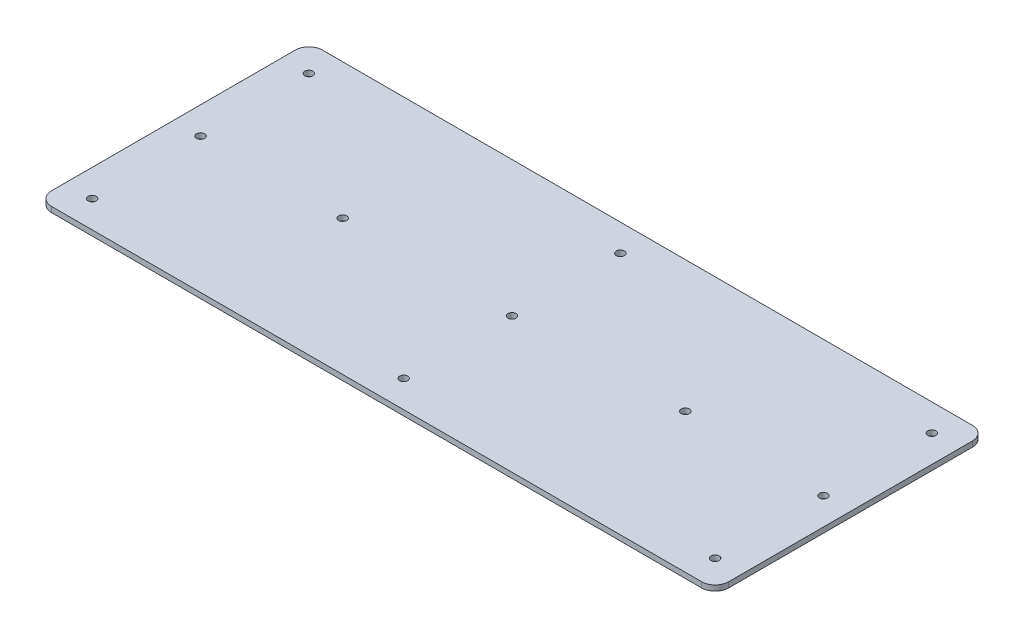
ISO-10303-21;
HEADER;
FILE_DESCRIPTION(('STEP AP214'),'2;1');
FILE_NAME('part.step','',(''),(''),'','','');
FILE_SCHEMA(('AUTOMOTIVE_DESIGN { 1 0 10303 214 1 1 1 1 }'));
ENDSEC;
DATA;
#1=APPLICATION_CONTEXT('core data for automotive mechanical design processes');
#2=APPLICATION_PROTOCOL_DEFINITION('international standard','automotive_design',2000,#1);
#3=PRODUCT_CONTEXT('',#1,'mechanical');
#4=PRODUCT('Part','Part','',(#3));
#5=PRODUCT_RELATED_PRODUCT_CATEGORY('part','',(#4));
#6=PRODUCT_DEFINITION_FORMATION('','',#4);
#7=PRODUCT_DEFINITION_CONTEXT('part definition',#1,'design');
#8=PRODUCT_DEFINITION('design','',#6,#7);
#9=PRODUCT_DEFINITION_SHAPE('','',#8);
#10=(LENGTH_UNIT() NAMED_UNIT(*) SI_UNIT(.MILLI.,.METRE.));
#11=(NAMED_UNIT(*) PLANE_ANGLE_UNIT() SI_UNIT($,.RADIAN.));
#12=(NAMED_UNIT(*) SI_UNIT($,.STERADIAN.) SOLID_ANGLE_UNIT());
#13=UNCERTAINTY_MEASURE_WITH_UNIT(LENGTH_MEASURE(1.E-05),#10,'distance_accuracy_value','');
#14=(GEOMETRIC_REPRESENTATION_CONTEXT(3) GLOBAL_UNCERTAINTY_ASSIGNED_CONTEXT((#13)) GLOBAL_UNIT_ASSIGNED_CONTEXT((#10,
#11,#12)) REPRESENTATION_CONTEXT('',''));
#15=CARTESIAN_POINT('',(0.,0.,0.));
#16=DIRECTION('',(0.,0.,1.));
#17=DIRECTION('',(1.,0.,0.));
#18=AXIS2_PLACEMENT_3D('',#15,#16,#17);
#19=CARTESIAN_POINT('',(120.,2.,-45.));
#20=DIRECTION('',(0.,1.,0.));
#21=DIRECTION('',(0.,0.,1.));
#22=AXIS2_PLACEMENT_3D('',#19,#20,#21);
#23=PLANE('',#22);
#24=CARTESIAN_POINT('',(-62.5,2.,0.));
#25=DIRECTION('',(0.,1.,0.));
#26=DIRECTION('',(0.,0.,1.));
#27=AXIS2_PLACEMENT_3D('',#24,#25,#26);
#28=CIRCLE('',#27,1.5);
#29=CARTESIAN_POINT('',(-62.5,2.,1.49999999999999));
#30=VERTEX_POINT('',#29);
#31=EDGE_CURVE('E231',#30,#30,#28,.T.);
#32=ORIENTED_EDGE('',*,*,#31,.F.);
#33=EDGE_LOOP('',(#32));
#34=FACE_BOUND('',#33,.T.);
#35=CARTESIAN_POINT('',(1.11022302462516E-13,2.,0.));
#36=DIRECTION('',(0.,1.,0.));
#37=DIRECTION('',(0.,0.,1.));
#38=AXIS2_PLACEMENT_3D('',#35,#36,#37);
#39=CIRCLE('',#38,1.5);
#40=CARTESIAN_POINT('',(1.11022302462516E-13,2.,1.49999999999996));
#41=VERTEX_POINT('',#40);
#42=EDGE_CURVE('E219',#41,#41,#39,.T.);
#43=ORIENTED_EDGE('',*,*,#42,.F.);
#44=EDGE_LOOP('',(#43));
#45=FACE_BOUND('',#44,.T.);
#46=CARTESIAN_POINT('',(0.,2.,40.));
#47=DIRECTION('',(0.,1.,0.));
#48=DIRECTION('',(0.,0.,1.));
#49=AXIS2_PLACEMENT_3D('',#46,#47,#48);
#50=CIRCLE('',#49,1.5);
#51=CARTESIAN_POINT('',(0.,2.,41.5));
#52=VERTEX_POINT('',#51);
#53=EDGE_CURVE('E207',#52,#52,#50,.T.);
#54=ORIENTED_EDGE('',*,*,#53,.F.);
#55=EDGE_LOOP('',(#54));
#56=FACE_BOUND('',#55,.T.);
#57=CARTESIAN_POINT('',(-115.,2.,0.));
#58=DIRECTION('',(0.,1.,0.));
#59=DIRECTION('',(0.,0.,1.));
#60=AXIS2_PLACEMENT_3D('',#57,#58,#59);
#61=CIRCLE('',#60,1.5);
#62=CARTESIAN_POINT('',(-115.,2.,1.50000000000002));
#63=VERTEX_POINT('',#62);
#64=EDGE_CURVE('E195',#63,#63,#61,.T.);
#65=ORIENTED_EDGE('',*,*,#64,.F.);
#66=EDGE_LOOP('',(#65));
#67=FACE_BOUND('',#66,.T.);
#68=CARTESIAN_POINT('',(-115.,2.,-40.));
#69=DIRECTION('',(0.,1.,0.));
#70=DIRECTION('',(0.,0.,1.));
#71=AXIS2_PLACEMENT_3D('',#68,#69,#70);
#72=CIRCLE('',#71,1.5);
#73=CARTESIAN_POINT('',(-115.,2.,-38.5));
#74=VERTEX_POINT('',#73);
#75=EDGE_CURVE('E183',#74,#74,#72,.T.);
#76=ORIENTED_EDGE('',*,*,#75,.F.);
#77=EDGE_LOOP('',(#76));
#78=FACE_BOUND('',#77,.T.);
#79=CARTESIAN_POINT('',(120.,2.,-45.));
#80=DIRECTION('',(0.,1.,0.));
#81=DIRECTION('',(0.,0.,1.));
#82=AXIS2_PLACEMENT_3D('',#79,#80,#81);
#83=CIRCLE('',#82,5.);
#84=CARTESIAN_POINT('',(125.,2.,-45.));
#85=VERTEX_POINT('',#84);
#86=CARTESIAN_POINT('',(120.,2.,-50.));
#87=VERTEX_POINT('',#86);
#88=EDGE_CURVE('E146',#85,#87,#83,.T.);
#89=ORIENTED_EDGE('',*,*,#88,.T.);
#90=DIRECTION('',(-1.,0.,0.));
#91=VECTOR('',#90,1.);
#92=CARTESIAN_POINT('',(-120.,2.,-50.));
#93=LINE('',#92,#91);
#94=CARTESIAN_POINT('',(-120.,2.,-50.));
#95=VERTEX_POINT('',#94);
#96=EDGE_CURVE('E94',#87,#95,#93,.T.);
#97=ORIENTED_EDGE('',*,*,#96,.T.);
#98=CARTESIAN_POINT('',(-120.,2.,-45.));
#99=DIRECTION('',(0.,1.,0.));
#100=DIRECTION('',(0.,0.,-1.));
#101=AXIS2_PLACEMENT_3D('',#98,#99,#100);
#102=CIRCLE('',#101,5.);
#103=CARTESIAN_POINT('',(-125.,2.,-45.));
#104=VERTEX_POINT('',#103);
#105=EDGE_CURVE('E161',#95,#104,#102,.T.);
#106=ORIENTED_EDGE('',*,*,#105,.T.);
#107=DIRECTION('',(0.,0.,1.));
#108=VECTOR('',#107,1.);
#109=CARTESIAN_POINT('',(-125.,2.,-45.));
#110=LINE('',#109,#108);
#111=CARTESIAN_POINT('',(-125.,2.,45.));
#112=VERTEX_POINT('',#111);
#113=EDGE_CURVE('E174',#104,#112,#110,.T.);
#114=ORIENTED_EDGE('',*,*,#113,.T.);
#115=CARTESIAN_POINT('',(-120.,2.,45.));
#116=DIRECTION('',(0.,1.,0.));
#117=DIRECTION('',(0.,0.,-1.));
#118=AXIS2_PLACEMENT_3D('',#115,#116,#117);
#119=CIRCLE('',#118,5.);
#120=CARTESIAN_POINT('',(-120.,2.,50.));
#121=VERTEX_POINT('',#120);
#122=EDGE_CURVE('E113',#112,#121,#119,.T.);
#123=ORIENTED_EDGE('',*,*,#122,.T.);
#124=DIRECTION('',(1.,0.,0.));
#125=VECTOR('',#124,1.);
#126=CARTESIAN_POINT('',(-120.,2.,50.));
#127=LINE('',#126,#125);
#128=CARTESIAN_POINT('',(120.,2.,50.));
#129=VERTEX_POINT('',#128);
#130=EDGE_CURVE('E107',#121,#129,#127,.T.);
#131=ORIENTED_EDGE('',*,*,#130,.T.);
#132=CARTESIAN_POINT('',(120.,2.,45.));
#133=DIRECTION('',(0.,1.,0.));
#134=DIRECTION('',(0.,0.,-1.));
#135=AXIS2_PLACEMENT_3D('',#132,#133,#134);
#136=CIRCLE('',#135,4.99999999999999);
#137=CARTESIAN_POINT('',(125.,2.,45.));
#138=VERTEX_POINT('',#137);
#139=EDGE_CURVE('E111',#129,#138,#136,.T.);
#140=ORIENTED_EDGE('',*,*,#139,.T.);
#141=DIRECTION('',(0.,0.,-1.));
#142=VECTOR('',#141,1.);
#143=CARTESIAN_POINT('',(125.,2.,-45.));
#144=LINE('',#143,#142);
#145=EDGE_CURVE('E51',#138,#85,#144,.T.);
#146=ORIENTED_EDGE('',*,*,#145,.T.);
#147=EDGE_LOOP('',(#89,#97,#106,#114,#123,#131,#140,#146));
#148=FACE_BOUND('',#147,.T.);
#149=CARTESIAN_POINT('',(0.,2.,-40.));
#150=DIRECTION('',(0.,1.,0.));
#151=DIRECTION('',(0.,0.,1.));
#152=AXIS2_PLACEMENT_3D('',#149,#150,#151);
#153=CIRCLE('',#152,1.5);
#154=CARTESIAN_POINT('',(0.,2.,-38.5));
#155=VERTEX_POINT('',#154);
#156=EDGE_CURVE('E135',#155,#155,#153,.T.);
#157=ORIENTED_EDGE('',*,*,#156,.F.);
#158=EDGE_LOOP('',(#157));
#159=FACE_BOUND('',#158,.T.);
#160=CARTESIAN_POINT('',(115.,2.,-40.));
#161=DIRECTION('',(0.,1.,0.));
#162=DIRECTION('',(0.,0.,1.));
#163=AXIS2_PLACEMENT_3D('',#160,#161,#162);
#164=CIRCLE('',#163,1.5);
#165=CARTESIAN_POINT('',(115.,2.,-38.5));
#166=VERTEX_POINT('',#165);
#167=EDGE_CURVE('E189',#166,#166,#164,.T.);
#168=ORIENTED_EDGE('',*,*,#167,.F.);
#169=EDGE_LOOP('',(#168));
#170=FACE_BOUND('',#169,.T.);
#171=CARTESIAN_POINT('',(-115.,2.,40.));
#172=DIRECTION('',(0.,1.,0.));
#173=DIRECTION('',(0.,0.,1.));
#174=AXIS2_PLACEMENT_3D('',#171,#172,#173);
#175=CIRCLE('',#174,1.5);
#176=CARTESIAN_POINT('',(-115.,2.,41.5));
#177=VERTEX_POINT('',#176);
#178=EDGE_CURVE('E201',#177,#177,#175,.T.);
#179=ORIENTED_EDGE('',*,*,#178,.F.);
#180=EDGE_LOOP('',(#179));
#181=FACE_BOUND('',#180,.T.);
#182=CARTESIAN_POINT('',(115.,2.,40.));
#183=DIRECTION('',(0.,1.,0.));
#184=DIRECTION('',(0.,0.,1.));
#185=AXIS2_PLACEMENT_3D('',#182,#183,#184);
#186=CIRCLE('',#185,1.5);
#187=CARTESIAN_POINT('',(115.,2.,41.5));
#188=VERTEX_POINT('',#187);
#189=EDGE_CURVE('E213',#188,#188,#186,.T.);
#190=ORIENTED_EDGE('',*,*,#189,.F.);
#191=EDGE_LOOP('',(#190));
#192=FACE_BOUND('',#191,.T.);
#193=CARTESIAN_POINT('',(115.,2.,0.));
#194=DIRECTION('',(0.,1.,0.));
#195=DIRECTION('',(0.,0.,1.));
#196=AXIS2_PLACEMENT_3D('',#193,#194,#195);
#197=CIRCLE('',#196,1.5);
#198=CARTESIAN_POINT('',(115.,2.,1.49999999999999));
#199=VERTEX_POINT('',#198);
#200=EDGE_CURVE('E225',#199,#199,#197,.T.);
#201=ORIENTED_EDGE('',*,*,#200,.F.);
#202=EDGE_LOOP('',(#201));
#203=FACE_BOUND('',#202,.T.);
#204=CARTESIAN_POINT('',(62.5,2.,-1.49999999999994));
#205=DIRECTION('',(0.,1.,0.));
#206=DIRECTION('',(0.,0.,1.));
#207=AXIS2_PLACEMENT_3D('',#204,#205,#206);
#208=CIRCLE('',#207,1.5);
#209=CARTESIAN_POINT('',(62.5,2.,0.));
#210=VERTEX_POINT('',#209);
#211=EDGE_CURVE('E237',#210,#210,#208,.T.);
#212=ORIENTED_EDGE('',*,*,#211,.F.);
#213=EDGE_LOOP('',(#212));
#214=FACE_BOUND('',#213,.T.);
#215=ADVANCED_FACE('F34',(#34,#45,#56,#67,#78,#148,#159,#170,#181,#192,#203,#214),#23,.T.);
#216=CARTESIAN_POINT('',(120.,0.,-45.));
#217=DIRECTION('',(0.,1.,0.));
#218=DIRECTION('',(0.,0.,1.));
#219=AXIS2_PLACEMENT_3D('',#216,#217,#218);
#220=PLANE('',#219);
#221=CARTESIAN_POINT('',(120.,0.,-45.));
#222=DIRECTION('',(0.,1.,0.));
#223=DIRECTION('',(0.,0.,1.));
#224=AXIS2_PLACEMENT_3D('',#221,#222,#223);
#225=CIRCLE('',#224,5.);
#226=CARTESIAN_POINT('',(125.,0.,-45.));
#227=VERTEX_POINT('',#226);
#228=CARTESIAN_POINT('',(120.,0.,-50.));
#229=VERTEX_POINT('',#228);
#230=EDGE_CURVE('E131',#227,#229,#225,.T.);
#231=ORIENTED_EDGE('',*,*,#230,.F.);
#232=DIRECTION('',(0.,0.,-1.));
#233=VECTOR('',#232,1.);
#234=CARTESIAN_POINT('',(125.,0.,-45.));
#235=LINE('',#234,#233);
#236=CARTESIAN_POINT('',(125.,0.,45.));
#237=VERTEX_POINT('',#236);
#238=EDGE_CURVE('E86',#237,#227,#235,.T.);
#239=ORIENTED_EDGE('',*,*,#238,.F.);
#240=CARTESIAN_POINT('',(120.,0.,45.));
#241=DIRECTION('',(0.,1.,0.));
#242=DIRECTION('',(0.,0.,-1.));
#243=AXIS2_PLACEMENT_3D('',#240,#241,#242);
#244=CIRCLE('',#243,4.99999999999999);
#245=CARTESIAN_POINT('',(120.,0.,50.));
#246=VERTEX_POINT('',#245);
#247=EDGE_CURVE('E80',#246,#237,#244,.T.);
#248=ORIENTED_EDGE('',*,*,#247,.F.);
#249=DIRECTION('',(1.,0.,0.));
#250=VECTOR('',#249,1.);
#251=CARTESIAN_POINT('',(-120.,0.,50.));
#252=LINE('',#251,#250);
#253=CARTESIAN_POINT('',(-120.,0.,50.));
#254=VERTEX_POINT('',#253);
#255=EDGE_CURVE('E121',#254,#246,#252,.T.);
#256=ORIENTED_EDGE('',*,*,#255,.F.);
#257=CARTESIAN_POINT('',(-120.,0.,45.));
#258=DIRECTION('',(0.,1.,0.));
#259=DIRECTION('',(0.,0.,-1.));
#260=AXIS2_PLACEMENT_3D('',#257,#258,#259);
#261=CIRCLE('',#260,5.);
#262=CARTESIAN_POINT('',(-125.,0.,45.));
#263=VERTEX_POINT('',#262);
#264=EDGE_CURVE('E141',#263,#254,#261,.T.);
#265=ORIENTED_EDGE('',*,*,#264,.F.);
#266=DIRECTION('',(0.,0.,1.));
#267=VECTOR('',#266,1.);
#268=CARTESIAN_POINT('',(-125.,0.,-45.));
#269=LINE('',#268,#267);
#270=CARTESIAN_POINT('',(-125.,0.,-45.));
#271=VERTEX_POINT('',#270);
#272=EDGE_CURVE('E139',#271,#263,#269,.T.);
#273=ORIENTED_EDGE('',*,*,#272,.F.);
#274=CARTESIAN_POINT('',(-120.,0.,-45.));
#275=DIRECTION('',(0.,1.,0.));
#276=DIRECTION('',(0.,0.,-1.));
#277=AXIS2_PLACEMENT_3D('',#274,#275,#276);
#278=CIRCLE('',#277,5.);
#279=CARTESIAN_POINT('',(-120.,0.,-50.));
#280=VERTEX_POINT('',#279);
#281=EDGE_CURVE('E137',#280,#271,#278,.T.);
#282=ORIENTED_EDGE('',*,*,#281,.F.);
#283=DIRECTION('',(-1.,0.,0.));
#284=VECTOR('',#283,1.);
#285=CARTESIAN_POINT('',(-120.,0.,-50.));
#286=LINE('',#285,#284);
#287=EDGE_CURVE('E134',#229,#280,#286,.T.);
#288=ORIENTED_EDGE('',*,*,#287,.F.);
#289=EDGE_LOOP('',(#231,#239,#248,#256,#265,#273,#282,#288));
#290=FACE_BOUND('',#289,.T.);
#291=CARTESIAN_POINT('',(0.,0.,-40.));
#292=DIRECTION('',(0.,1.,0.));
#293=DIRECTION('',(0.,0.,1.));
#294=AXIS2_PLACEMENT_3D('',#291,#292,#293);
#295=CIRCLE('',#294,1.5);
#296=CARTESIAN_POINT('',(0.,0.,-38.5));
#297=VERTEX_POINT('',#296);
#298=EDGE_CURVE('E180',#297,#297,#295,.T.);
#299=ORIENTED_EDGE('',*,*,#298,.T.);
#300=EDGE_LOOP('',(#299));
#301=FACE_BOUND('',#300,.T.);
#302=CARTESIAN_POINT('',(-115.,0.,-40.));
#303=DIRECTION('',(0.,1.,0.));
#304=DIRECTION('',(0.,0.,1.));
#305=AXIS2_PLACEMENT_3D('',#302,#303,#304);
#306=CIRCLE('',#305,1.5);
#307=CARTESIAN_POINT('',(-115.,0.,-38.5));
#308=VERTEX_POINT('',#307);
#309=EDGE_CURVE('E186',#308,#308,#306,.T.);
#310=ORIENTED_EDGE('',*,*,#309,.T.);
#311=EDGE_LOOP('',(#310));
#312=FACE_BOUND('',#311,.T.);
#313=CARTESIAN_POINT('',(115.,0.,-40.));
#314=DIRECTION('',(0.,1.,0.));
#315=DIRECTION('',(0.,0.,1.));
#316=AXIS2_PLACEMENT_3D('',#313,#314,#315);
#317=CIRCLE('',#316,1.5);
#318=CARTESIAN_POINT('',(115.,0.,-38.5));
#319=VERTEX_POINT('',#318);
#320=EDGE_CURVE('E192',#319,#319,#317,.T.);
#321=ORIENTED_EDGE('',*,*,#320,.T.);
#322=EDGE_LOOP('',(#321));
#323=FACE_BOUND('',#322,.T.);
#324=CARTESIAN_POINT('',(-115.,0.,0.));
#325=DIRECTION('',(0.,1.,0.));
#326=DIRECTION('',(0.,0.,1.));
#327=AXIS2_PLACEMENT_3D('',#324,#325,#326);
#328=CIRCLE('',#327,1.5);
#329=CARTESIAN_POINT('',(-115.,0.,1.50000000000002));
#330=VERTEX_POINT('',#329);
#331=EDGE_CURVE('E198',#330,#330,#328,.T.);
#332=ORIENTED_EDGE('',*,*,#331,.T.);
#333=EDGE_LOOP('',(#332));
#334=FACE_BOUND('',#333,.T.);
#335=CARTESIAN_POINT('',(-115.,0.,40.));
#336=DIRECTION('',(0.,1.,0.));
#337=DIRECTION('',(0.,0.,1.));
#338=AXIS2_PLACEMENT_3D('',#335,#336,#337);
#339=CIRCLE('',#338,1.5);
#340=CARTESIAN_POINT('',(-115.,0.,41.5));
#341=VERTEX_POINT('',#340);
#342=EDGE_CURVE('E204',#341,#341,#339,.T.);
#343=ORIENTED_EDGE('',*,*,#342,.T.);
#344=EDGE_LOOP('',(#343));
#345=FACE_BOUND('',#344,.T.);
#346=CARTESIAN_POINT('',(0.,0.,40.));
#347=DIRECTION('',(0.,1.,0.));
#348=DIRECTION('',(0.,0.,1.));
#349=AXIS2_PLACEMENT_3D('',#346,#347,#348);
#350=CIRCLE('',#349,1.5);
#351=CARTESIAN_POINT('',(0.,0.,41.5));
#352=VERTEX_POINT('',#351);
#353=EDGE_CURVE('E210',#352,#352,#350,.T.);
#354=ORIENTED_EDGE('',*,*,#353,.T.);
#355=EDGE_LOOP('',(#354));
#356=FACE_BOUND('',#355,.T.);
#357=CARTESIAN_POINT('',(115.,0.,40.));
#358=DIRECTION('',(0.,1.,0.));
#359=DIRECTION('',(0.,0.,1.));
#360=AXIS2_PLACEMENT_3D('',#357,#358,#359);
#361=CIRCLE('',#360,1.5);
#362=CARTESIAN_POINT('',(115.,0.,41.5));
#363=VERTEX_POINT('',#362);
#364=EDGE_CURVE('E216',#363,#363,#361,.T.);
#365=ORIENTED_EDGE('',*,*,#364,.T.);
#366=EDGE_LOOP('',(#365));
#367=FACE_BOUND('',#366,.T.);
#368=CARTESIAN_POINT('',(1.11022302462516E-13,0.,0.));
#369=DIRECTION('',(0.,1.,0.));
#370=DIRECTION('',(0.,0.,1.));
#371=AXIS2_PLACEMENT_3D('',#368,#369,#370);
#372=CIRCLE('',#371,1.5);
#373=CARTESIAN_POINT('',(1.11022302462516E-13,0.,1.49999999999996));
#374=VERTEX_POINT('',#373);
#375=EDGE_CURVE('E222',#374,#374,#372,.T.);
#376=ORIENTED_EDGE('',*,*,#375,.T.);
#377=EDGE_LOOP('',(#376));
#378=FACE_BOUND('',#377,.T.);
#379=CARTESIAN_POINT('',(115.,0.,0.));
#380=DIRECTION('',(0.,1.,0.));
#381=DIRECTION('',(0.,0.,1.));
#382=AXIS2_PLACEMENT_3D('',#379,#380,#381);
#383=CIRCLE('',#382,1.5);
#384=CARTESIAN_POINT('',(115.,0.,1.49999999999999));
#385=VERTEX_POINT('',#384);
#386=EDGE_CURVE('E228',#385,#385,#383,.T.);
#387=ORIENTED_EDGE('',*,*,#386,.T.);
#388=EDGE_LOOP('',(#387));
#389=FACE_BOUND('',#388,.T.);
#390=CARTESIAN_POINT('',(-62.5,0.,0.));
#391=DIRECTION('',(0.,1.,0.));
#392=DIRECTION('',(0.,0.,1.));
#393=AXIS2_PLACEMENT_3D('',#390,#391,#392);
#394=CIRCLE('',#393,1.5);
#395=CARTESIAN_POINT('',(-62.5,0.,1.49999999999999));
#396=VERTEX_POINT('',#395);
#397=EDGE_CURVE('E234',#396,#396,#394,.T.);
#398=ORIENTED_EDGE('',*,*,#397,.T.);
#399=EDGE_LOOP('',(#398));
#400=FACE_BOUND('',#399,.T.);
#401=CARTESIAN_POINT('',(62.5,0.,-1.49999999999994));
#402=DIRECTION('',(0.,1.,0.));
#403=DIRECTION('',(0.,0.,1.));
#404=AXIS2_PLACEMENT_3D('',#401,#402,#403);
#405=CIRCLE('',#404,1.5);
#406=CARTESIAN_POINT('',(62.5,0.,0.));
#407=VERTEX_POINT('',#406);
#408=EDGE_CURVE('E240',#407,#407,#405,.T.);
#409=ORIENTED_EDGE('',*,*,#408,.T.);
#410=EDGE_LOOP('',(#409));
#411=FACE_BOUND('',#410,.T.);
#412=ADVANCED_FACE('F165',(#290,#301,#312,#323,#334,#345,#356,#367,#378,#389,#400,#411),#220,.F.);
#413=CARTESIAN_POINT('',(120.,2.,-45.));
#414=DIRECTION('',(0.,-1.,0.));
#415=DIRECTION('',(0.,0.,-1.));
#416=AXIS2_PLACEMENT_3D('',#413,#414,#415);
#417=CYLINDRICAL_SURFACE('',#416,5.);
#418=ORIENTED_EDGE('',*,*,#230,.T.);
#419=DIRECTION('',(0.,-1.,0.));
#420=VECTOR('',#419,1.);
#421=CARTESIAN_POINT('',(120.,2.,-50.));
#422=LINE('',#421,#420);
#423=EDGE_CURVE('E11',#87,#229,#422,.T.);
#424=ORIENTED_EDGE('',*,*,#423,.F.);
#425=ORIENTED_EDGE('',*,*,#88,.F.);
#426=DIRECTION('',(0.,-1.,0.));
#427=VECTOR('',#426,1.);
#428=CARTESIAN_POINT('',(125.,2.,-45.));
#429=LINE('',#428,#427);
#430=EDGE_CURVE('E127',#85,#227,#429,.T.);
#431=ORIENTED_EDGE('',*,*,#430,.T.);
#432=EDGE_LOOP('',(#418,#424,#425,#431));
#433=FACE_BOUND('',#432,.T.);
#434=ADVANCED_FACE('F36',(#433),#417,.T.);
#435=CARTESIAN_POINT('',(-120.,2.,-50.));
#436=DIRECTION('',(0.,0.,1.));
#437=DIRECTION('',(1.,0.,0.));
#438=AXIS2_PLACEMENT_3D('',#435,#436,#437);
#439=PLANE('',#438);
#440=ORIENTED_EDGE('',*,*,#287,.T.);
#441=DIRECTION('',(0.,-1.,0.));
#442=VECTOR('',#441,1.);
#443=CARTESIAN_POINT('',(-120.,2.,-50.));
#444=LINE('',#443,#442);
#445=EDGE_CURVE('E43',#95,#280,#444,.T.);
#446=ORIENTED_EDGE('',*,*,#445,.F.);
#447=ORIENTED_EDGE('',*,*,#96,.F.);
#448=ORIENTED_EDGE('',*,*,#423,.T.);
#449=EDGE_LOOP('',(#440,#446,#447,#448));
#450=FACE_BOUND('',#449,.T.);
#451=ADVANCED_FACE('F274',(#450),#439,.F.);
#452=CARTESIAN_POINT('',(-120.,2.,-45.));
#453=DIRECTION('',(0.,-1.,0.));
#454=DIRECTION('',(0.,0.,-1.));
#455=AXIS2_PLACEMENT_3D('',#452,#453,#454);
#456=CYLINDRICAL_SURFACE('',#455,5.);
#457=ORIENTED_EDGE('',*,*,#281,.T.);
#458=DIRECTION('',(0.,-1.,0.));
#459=VECTOR('',#458,1.);
#460=CARTESIAN_POINT('',(-125.,2.,-45.));
#461=LINE('',#460,#459);
#462=EDGE_CURVE('E153',#104,#271,#461,.T.);
#463=ORIENTED_EDGE('',*,*,#462,.F.);
#464=ORIENTED_EDGE('',*,*,#105,.F.);
#465=ORIENTED_EDGE('',*,*,#445,.T.);
#466=EDGE_LOOP('',(#457,#463,#464,#465));
#467=FACE_BOUND('',#466,.T.);
#468=ADVANCED_FACE('F159',(#467),#456,.T.);
#469=CARTESIAN_POINT('',(-125.,2.,-45.));
#470=DIRECTION('',(1.,0.,0.));
#471=DIRECTION('',(0.,0.,-1.));
#472=AXIS2_PLACEMENT_3D('',#469,#470,#471);
#473=PLANE('',#472);
#474=ORIENTED_EDGE('',*,*,#272,.T.);
#475=DIRECTION('',(0.,-1.,0.));
#476=VECTOR('',#475,1.);
#477=CARTESIAN_POINT('',(-125.,2.,45.));
#478=LINE('',#477,#476);
#479=EDGE_CURVE('E150',#112,#263,#478,.T.);
#480=ORIENTED_EDGE('',*,*,#479,.F.);
#481=ORIENTED_EDGE('',*,*,#113,.F.);
#482=ORIENTED_EDGE('',*,*,#462,.T.);
#483=EDGE_LOOP('',(#474,#480,#481,#482));
#484=FACE_BOUND('',#483,.T.);
#485=ADVANCED_FACE('F170',(#484),#473,.F.);
#486=CARTESIAN_POINT('',(-120.,2.,45.));
#487=DIRECTION('',(0.,-1.,0.));
#488=DIRECTION('',(0.,0.,-1.));
#489=AXIS2_PLACEMENT_3D('',#486,#487,#488);
#490=CYLINDRICAL_SURFACE('',#489,5.);
#491=ORIENTED_EDGE('',*,*,#264,.T.);
#492=DIRECTION('',(0.,-1.,0.));
#493=VECTOR('',#492,1.);
#494=CARTESIAN_POINT('',(-120.,2.,50.));
#495=LINE('',#494,#493);
#496=EDGE_CURVE('E122',#121,#254,#495,.T.);
#497=ORIENTED_EDGE('',*,*,#496,.F.);
#498=ORIENTED_EDGE('',*,*,#122,.F.);
#499=ORIENTED_EDGE('',*,*,#479,.T.);
#500=EDGE_LOOP('',(#491,#497,#498,#499));
#501=FACE_BOUND('',#500,.T.);
#502=ADVANCED_FACE('F173',(#501),#490,.T.);
#503=CARTESIAN_POINT('',(-120.,2.,50.));
#504=DIRECTION('',(0.,0.,-1.));
#505=DIRECTION('',(-1.,0.,0.));
#506=AXIS2_PLACEMENT_3D('',#503,#504,#505);
#507=PLANE('',#506);
#508=ORIENTED_EDGE('',*,*,#255,.T.);
#509=DIRECTION('',(0.,-1.,0.));
#510=VECTOR('',#509,1.);
#511=CARTESIAN_POINT('',(120.,2.,50.));
#512=LINE('',#511,#510);
#513=EDGE_CURVE('E118',#129,#246,#512,.T.);
#514=ORIENTED_EDGE('',*,*,#513,.F.);
#515=ORIENTED_EDGE('',*,*,#130,.F.);
#516=ORIENTED_EDGE('',*,*,#496,.T.);
#517=EDGE_LOOP('',(#508,#514,#515,#516));
#518=FACE_BOUND('',#517,.T.);
#519=ADVANCED_FACE('F119',(#518),#507,.F.);
#520=CARTESIAN_POINT('',(120.,2.,45.));
#521=DIRECTION('',(0.,-1.,0.));
#522=DIRECTION('',(0.,0.,-1.));
#523=AXIS2_PLACEMENT_3D('',#520,#521,#522);
#524=CYLINDRICAL_SURFACE('',#523,4.99999999999999);
#525=ORIENTED_EDGE('',*,*,#247,.T.);
#526=DIRECTION('',(0.,-1.,0.));
#527=VECTOR('',#526,1.);
#528=CARTESIAN_POINT('',(125.,2.,45.));
#529=LINE('',#528,#527);
#530=EDGE_CURVE('E123',#138,#237,#529,.T.);
#531=ORIENTED_EDGE('',*,*,#530,.F.);
#532=ORIENTED_EDGE('',*,*,#139,.F.);
#533=ORIENTED_EDGE('',*,*,#513,.T.);
#534=EDGE_LOOP('',(#525,#531,#532,#533));
#535=FACE_BOUND('',#534,.T.);
#536=ADVANCED_FACE('F125',(#535),#524,.T.);
#537=CARTESIAN_POINT('',(125.,2.,-45.));
#538=DIRECTION('',(-1.,0.,0.));
#539=DIRECTION('',(0.,0.,1.));
#540=AXIS2_PLACEMENT_3D('',#537,#538,#539);
#541=PLANE('',#540);
#542=ORIENTED_EDGE('',*,*,#238,.T.);
#543=ORIENTED_EDGE('',*,*,#430,.F.);
#544=ORIENTED_EDGE('',*,*,#145,.F.);
#545=ORIENTED_EDGE('',*,*,#530,.T.);
#546=EDGE_LOOP('',(#542,#543,#544,#545));
#547=FACE_BOUND('',#546,.T.);
#548=ADVANCED_FACE('F262',(#547),#541,.F.);
#549=CARTESIAN_POINT('',(0.,2.,-40.));
#550=DIRECTION('',(0.,-1.,0.));
#551=DIRECTION('',(0.,0.,-1.));
#552=AXIS2_PLACEMENT_3D('',#549,#550,#551);
#553=CYLINDRICAL_SURFACE('',#552,1.5);
#554=ORIENTED_EDGE('',*,*,#156,.T.);
#555=EDGE_LOOP('',(#554));
#556=FACE_BOUND('',#555,.T.);
#557=ORIENTED_EDGE('',*,*,#298,.F.);
#558=EDGE_LOOP('',(#557));
#559=FACE_BOUND('',#558,.T.);
#560=ADVANCED_FACE('F259',(#556,#559),#553,.F.);
#561=CARTESIAN_POINT('',(-115.,2.,-40.));
#562=DIRECTION('',(0.,-1.,0.));
#563=DIRECTION('',(0.,0.,-1.));
#564=AXIS2_PLACEMENT_3D('',#561,#562,#563);
#565=CYLINDRICAL_SURFACE('',#564,1.5);
#566=ORIENTED_EDGE('',*,*,#75,.T.);
#567=EDGE_LOOP('',(#566));
#568=FACE_BOUND('',#567,.T.);
#569=ORIENTED_EDGE('',*,*,#309,.F.);
#570=EDGE_LOOP('',(#569));
#571=FACE_BOUND('',#570,.T.);
#572=ADVANCED_FACE('F338',(#568,#571),#565,.F.);
#573=CARTESIAN_POINT('',(115.,2.,-40.));
#574=DIRECTION('',(0.,-1.,0.));
#575=DIRECTION('',(0.,0.,-1.));
#576=AXIS2_PLACEMENT_3D('',#573,#574,#575);
#577=CYLINDRICAL_SURFACE('',#576,1.5);
#578=ORIENTED_EDGE('',*,*,#167,.T.);
#579=EDGE_LOOP('',(#578));
#580=FACE_BOUND('',#579,.T.);
#581=ORIENTED_EDGE('',*,*,#320,.F.);
#582=EDGE_LOOP('',(#581));
#583=FACE_BOUND('',#582,.T.);
#584=ADVANCED_FACE('F346',(#580,#583),#577,.F.);
#585=CARTESIAN_POINT('',(-115.,2.,0.));
#586=DIRECTION('',(0.,-1.,0.));
#587=DIRECTION('',(0.,0.,-1.));
#588=AXIS2_PLACEMENT_3D('',#585,#586,#587);
#589=CYLINDRICAL_SURFACE('',#588,1.5);
#590=ORIENTED_EDGE('',*,*,#64,.T.);
#591=EDGE_LOOP('',(#590));
#592=FACE_BOUND('',#591,.T.);
#593=ORIENTED_EDGE('',*,*,#331,.F.);
#594=EDGE_LOOP('',(#593));
#595=FACE_BOUND('',#594,.T.);
#596=ADVANCED_FACE('F354',(#592,#595),#589,.F.);
#597=CARTESIAN_POINT('',(-115.,2.,40.));
#598=DIRECTION('',(0.,-1.,0.));
#599=DIRECTION('',(0.,0.,-1.));
#600=AXIS2_PLACEMENT_3D('',#597,#598,#599);
#601=CYLINDRICAL_SURFACE('',#600,1.5);
#602=ORIENTED_EDGE('',*,*,#178,.T.);
#603=EDGE_LOOP('',(#602));
#604=FACE_BOUND('',#603,.T.);
#605=ORIENTED_EDGE('',*,*,#342,.F.);
#606=EDGE_LOOP('',(#605));
#607=FACE_BOUND('',#606,.T.);
#608=ADVANCED_FACE('F363',(#604,#607),#601,.F.);
#609=CARTESIAN_POINT('',(0.,2.,40.));
#610=DIRECTION('',(0.,-1.,0.));
#611=DIRECTION('',(0.,0.,-1.));
#612=AXIS2_PLACEMENT_3D('',#609,#610,#611);
#613=CYLINDRICAL_SURFACE('',#612,1.5);
#614=ORIENTED_EDGE('',*,*,#53,.T.);
#615=EDGE_LOOP('',(#614));
#616=FACE_BOUND('',#615,.T.);
#617=ORIENTED_EDGE('',*,*,#353,.F.);
#618=EDGE_LOOP('',(#617));
#619=FACE_BOUND('',#618,.T.);
#620=ADVANCED_FACE('F372',(#616,#619),#613,.F.);
#621=CARTESIAN_POINT('',(115.,2.,40.));
#622=DIRECTION('',(0.,-1.,0.));
#623=DIRECTION('',(0.,0.,-1.));
#624=AXIS2_PLACEMENT_3D('',#621,#622,#623);
#625=CYLINDRICAL_SURFACE('',#624,1.5);
#626=ORIENTED_EDGE('',*,*,#189,.T.);
#627=EDGE_LOOP('',(#626));
#628=FACE_BOUND('',#627,.T.);
#629=ORIENTED_EDGE('',*,*,#364,.F.);
#630=EDGE_LOOP('',(#629));
#631=FACE_BOUND('',#630,.T.);
#632=ADVANCED_FACE('F381',(#628,#631),#625,.F.);
#633=CARTESIAN_POINT('',(1.11022302462516E-13,2.,0.));
#634=DIRECTION('',(0.,-1.,0.));
#635=DIRECTION('',(0.,0.,-1.));
#636=AXIS2_PLACEMENT_3D('',#633,#634,#635);
#637=CYLINDRICAL_SURFACE('',#636,1.5);
#638=ORIENTED_EDGE('',*,*,#42,.T.);
#639=EDGE_LOOP('',(#638));
#640=FACE_BOUND('',#639,.T.);
#641=ORIENTED_EDGE('',*,*,#375,.F.);
#642=EDGE_LOOP('',(#641));
#643=FACE_BOUND('',#642,.T.);
#644=ADVANCED_FACE('F390',(#640,#643),#637,.F.);
#645=CARTESIAN_POINT('',(115.,2.,0.));
#646=DIRECTION('',(0.,-1.,0.));
#647=DIRECTION('',(0.,0.,-1.));
#648=AXIS2_PLACEMENT_3D('',#645,#646,#647);
#649=CYLINDRICAL_SURFACE('',#648,1.5);
#650=ORIENTED_EDGE('',*,*,#200,.T.);
#651=EDGE_LOOP('',(#650));
#652=FACE_BOUND('',#651,.T.);
#653=ORIENTED_EDGE('',*,*,#386,.F.);
#654=EDGE_LOOP('',(#653));
#655=FACE_BOUND('',#654,.T.);
#656=ADVANCED_FACE('F399',(#652,#655),#649,.F.);
#657=CARTESIAN_POINT('',(-62.5,2.,0.));
#658=DIRECTION('',(0.,-1.,0.));
#659=DIRECTION('',(0.,0.,-1.));
#660=AXIS2_PLACEMENT_3D('',#657,#658,#659);
#661=CYLINDRICAL_SURFACE('',#660,1.5);
#662=ORIENTED_EDGE('',*,*,#31,.T.);
#663=EDGE_LOOP('',(#662));
#664=FACE_BOUND('',#663,.T.);
#665=ORIENTED_EDGE('',*,*,#397,.F.);
#666=EDGE_LOOP('',(#665));
#667=FACE_BOUND('',#666,.T.);
#668=ADVANCED_FACE('F408',(#664,#667),#661,.F.);
#669=CARTESIAN_POINT('',(62.5,2.,-1.49999999999994));
#670=DIRECTION('',(0.,-1.,0.));
#671=DIRECTION('',(0.,0.,-1.));
#672=AXIS2_PLACEMENT_3D('',#669,#670,#671);
#673=CYLINDRICAL_SURFACE('',#672,1.5);
#674=ORIENTED_EDGE('',*,*,#211,.T.);
#675=EDGE_LOOP('',(#674));
#676=FACE_BOUND('',#675,.T.);
#677=ORIENTED_EDGE('',*,*,#408,.F.);
#678=EDGE_LOOP('',(#677));
#679=FACE_BOUND('',#678,.T.);
#680=ADVANCED_FACE('F246',(#676,#679),#673,.F.);
#681=CLOSED_SHELL('',(#215,#412,#434,#451,#468,#485,#502,#519,#536,#548,#560,#572,#584,#596,
#608,#620,#632,#644,#656,#668,#680));
#682=MANIFOLD_SOLID_BREP('B2',#681);
#683=ADVANCED_BREP_SHAPE_REPRESENTATION('',(#18,#682),#14);
#684=SHAPE_DEFINITION_REPRESENTATION(#9,#683);
ENDSEC;
END-ISO-10303-21;
